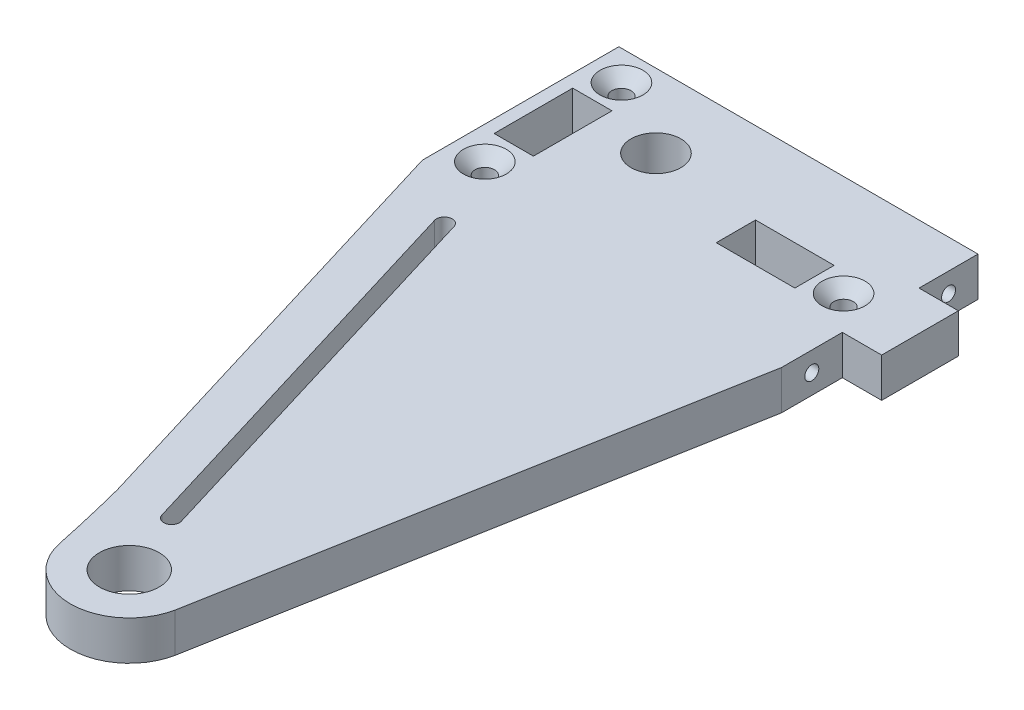
ISO-10303-21;
HEADER;
FILE_DESCRIPTION(('STEP AP214'),'2;1');
FILE_NAME('part.step','',(''),(''),'','','');
FILE_SCHEMA(('AUTOMOTIVE_DESIGN { 1 0 10303 214 1 1 1 1 }'));
ENDSEC;
DATA;
#1=APPLICATION_CONTEXT('core data for automotive mechanical design processes');
#2=APPLICATION_PROTOCOL_DEFINITION('international standard','automotive_design',2000,#1);
#3=PRODUCT_CONTEXT('',#1,'mechanical');
#4=PRODUCT('Part','Part','',(#3));
#5=PRODUCT_RELATED_PRODUCT_CATEGORY('part','',(#4));
#6=PRODUCT_DEFINITION_FORMATION('','',#4);
#7=PRODUCT_DEFINITION_CONTEXT('part definition',#1,'design');
#8=PRODUCT_DEFINITION('design','',#6,#7);
#9=PRODUCT_DEFINITION_SHAPE('','',#8);
#10=(LENGTH_UNIT() NAMED_UNIT(*) SI_UNIT(.MILLI.,.METRE.));
#11=(NAMED_UNIT(*) PLANE_ANGLE_UNIT() SI_UNIT($,.RADIAN.));
#12=(NAMED_UNIT(*) SI_UNIT($,.STERADIAN.) SOLID_ANGLE_UNIT());
#13=UNCERTAINTY_MEASURE_WITH_UNIT(LENGTH_MEASURE(1.E-05),#10,'distance_accuracy_value','');
#14=(GEOMETRIC_REPRESENTATION_CONTEXT(3) GLOBAL_UNCERTAINTY_ASSIGNED_CONTEXT((#13)) GLOBAL_UNIT_ASSIGNED_CONTEXT((#10,
#11,#12)) REPRESENTATION_CONTEXT('',''));
#15=CARTESIAN_POINT('',(0.,0.,0.));
#16=DIRECTION('',(0.,0.,1.));
#17=DIRECTION('',(1.,0.,0.));
#18=AXIS2_PLACEMENT_3D('',#15,#16,#17);
#19=CARTESIAN_POINT('',(0.,6.35,0.));
#20=DIRECTION('',(0.,1.,0.));
#21=DIRECTION('',(0.,0.,1.));
#22=AXIS2_PLACEMENT_3D('',#19,#20,#21);
#23=PLANE('',#22);
#24=CARTESIAN_POINT('',(19.0431962450902,6.35,-96.393));
#25=DIRECTION('',(0.,1.,0.));
#26=DIRECTION('',(0.,0.,1.));
#27=AXIS2_PLACEMENT_3D('',#24,#25,#26);
#28=CIRCLE('',#27,3.46709999999997);
#29=CARTESIAN_POINT('',(19.0431962450902,6.35,-92.9259));
#30=VERTEX_POINT('',#29);
#31=EDGE_CURVE('E385',#30,#30,#28,.F.);
#32=ORIENTED_EDGE('',*,*,#31,.T.);
#33=EDGE_LOOP('',(#32));
#34=FACE_BOUND('',#33,.T.);
#35=CARTESIAN_POINT('',(-28.394285298128,6.35,-85.856962938398));
#36=DIRECTION('',(0.,1.,0.));
#37=DIRECTION('',(0.,0.,1.));
#38=AXIS2_PLACEMENT_3D('',#35,#36,#37);
#39=CIRCLE('',#38,3.46709999999997);
#40=CARTESIAN_POINT('',(-28.394285298128,6.35,-82.389862938398));
#41=VERTEX_POINT('',#40);
#42=EDGE_CURVE('E382',#41,#41,#39,.F.);
#43=ORIENTED_EDGE('',*,*,#42,.T.);
#44=EDGE_LOOP('',(#43));
#45=FACE_BOUND('',#44,.T.);
#46=CARTESIAN_POINT('',(-28.4151324493854,6.35,-107.954943271274));
#47=DIRECTION('',(0.,1.,0.));
#48=DIRECTION('',(0.,0.,1.));
#49=AXIS2_PLACEMENT_3D('',#46,#47,#48);
#50=CIRCLE('',#49,3.46709999999997);
#51=CARTESIAN_POINT('',(-28.4151324493854,6.35,-104.487843271274));
#52=VERTEX_POINT('',#51);
#53=EDGE_CURVE('E379',#52,#52,#50,.F.);
#54=ORIENTED_EDGE('',*,*,#53,.T.);
#55=EDGE_LOOP('',(#54));
#56=FACE_BOUND('',#55,.T.);
#57=DIRECTION('',(-0.29042094398933,0.,-0.956898989074785));
#58=VECTOR('',#57,1.);
#59=CARTESIAN_POINT('',(-2.60239940005327,6.35,-11.0218358933724));
#60=LINE('',#59,#58);
#61=CARTESIAN_POINT('',(-2.60239940005327,6.35,-11.0218358933724));
#62=VERTEX_POINT('',#61);
#63=CARTESIAN_POINT('',(-21.812532437852,6.35,-74.3167092980163));
#64=VERTEX_POINT('',#63);
#65=EDGE_CURVE('E231',#62,#64,#60,.T.);
#66=ORIENTED_EDGE('',*,*,#65,.F.);
#67=CARTESIAN_POINT('',(-3.81766111617824,6.35,-10.653001294506));
#68=DIRECTION('',(0.,1.,0.));
#69=DIRECTION('',(0.,0.,1.));
#70=AXIS2_PLACEMENT_3D('',#67,#68,#69);
#71=CIRCLE('',#70,1.27);
#72=CARTESIAN_POINT('',(-5.03292283230322,6.35,-10.2841666956395));
#73=VERTEX_POINT('',#72);
#74=EDGE_CURVE('E229',#73,#62,#71,.T.);
#75=ORIENTED_EDGE('',*,*,#74,.F.);
#76=DIRECTION('',(0.29042094398933,0.,0.956898989074785));
#77=VECTOR('',#76,1.);
#78=CARTESIAN_POINT('',(-5.03292283230322,6.35,-10.2841666956395));
#79=LINE('',#78,#77);
#80=CARTESIAN_POINT('',(-24.243055870102,6.35,-73.5790401002834));
#81=VERTEX_POINT('',#80);
#82=EDGE_CURVE('E237',#81,#73,#79,.T.);
#83=ORIENTED_EDGE('',*,*,#82,.F.);
#84=CARTESIAN_POINT('',(-23.027794153977,6.35,-73.9478746991498));
#85=DIRECTION('',(0.,1.,0.));
#86=DIRECTION('',(0.,0.,1.));
#87=AXIS2_PLACEMENT_3D('',#84,#85,#86);
#88=CIRCLE('',#87,1.27);
#89=EDGE_CURVE('E234',#64,#81,#88,.T.);
#90=ORIENTED_EDGE('',*,*,#89,.F.);
#91=EDGE_LOOP('',(#66,#75,#83,#90));
#92=FACE_BOUND('',#91,.T.);
#93=CARTESIAN_POINT('',(0.,6.35,0.));
#94=DIRECTION('',(0.,1.,0.));
#95=DIRECTION('',(0.,0.,1.));
#96=AXIS2_PLACEMENT_3D('',#93,#94,#95);
#97=CIRCLE('',#96,4.826);
#98=CARTESIAN_POINT('',(0.,6.35,4.826));
#99=VERTEX_POINT('',#98);
#100=EDGE_CURVE('E291',#99,#99,#97,.T.);
#101=ORIENTED_EDGE('',*,*,#100,.F.);
#102=EDGE_LOOP('',(#101));
#103=FACE_BOUND('',#102,.T.);
#104=DIRECTION('',(-1.,0.,0.));
#105=VECTOR('',#104,1.);
#106=CARTESIAN_POINT('',(24.384,6.35,-103.251));
#107=LINE('',#106,#105);
#108=CARTESIAN_POINT('',(30.734,6.35,-103.251));
#109=VERTEX_POINT('',#108);
#110=CARTESIAN_POINT('',(24.384,6.35,-103.251));
#111=VERTEX_POINT('',#110);
#112=EDGE_CURVE('E297',#109,#111,#107,.T.);
#113=ORIENTED_EDGE('',*,*,#112,.T.);
#114=DIRECTION('',(0.,0.,-1.));
#115=VECTOR('',#114,1.);
#116=CARTESIAN_POINT('',(24.384,6.35,-112.776));
#117=LINE('',#116,#115);
#118=CARTESIAN_POINT('',(24.384,6.35,-112.776));
#119=VERTEX_POINT('',#118);
#120=EDGE_CURVE('E300',#111,#119,#117,.T.);
#121=ORIENTED_EDGE('',*,*,#120,.T.);
#122=DIRECTION('',(-1.,0.,0.));
#123=VECTOR('',#122,1.);
#124=CARTESIAN_POINT('',(24.384,6.35,-112.776));
#125=LINE('',#124,#123);
#126=CARTESIAN_POINT('',(-33.655,6.35,-112.776));
#127=VERTEX_POINT('',#126);
#128=EDGE_CURVE('E303',#119,#127,#125,.T.);
#129=ORIENTED_EDGE('',*,*,#128,.T.);
#130=DIRECTION('',(0.,0.,1.));
#131=VECTOR('',#130,1.);
#132=CARTESIAN_POINT('',(-33.655,6.35,-112.776));
#133=LINE('',#132,#131);
#134=CARTESIAN_POINT('',(-33.655,6.35,-81.026));
#135=VERTEX_POINT('',#134);
#136=EDGE_CURVE('E305',#127,#135,#133,.T.);
#137=ORIENTED_EDGE('',*,*,#136,.T.);
#138=DIRECTION('',(0.29042094398933,0.,0.956898989074786));
#139=VECTOR('',#138,1.);
#140=CARTESIAN_POINT('',(-33.655,6.35,-81.026));
#141=LINE('',#140,#139);
#142=CARTESIAN_POINT('',(-12.1846982833551,6.35,-10.2841666956395));
#143=VERTEX_POINT('',#142);
#144=EDGE_CURVE('E307',#135,#143,#141,.T.);
#145=ORIENTED_EDGE('',*,*,#144,.T.);
#146=CARTESIAN_POINT('',(-273.056211371,6.35,57.1826039304755));
#147=DIRECTION('',(0.,-1.,0.));
#148=DIRECTION('',(0.,0.,-1.));
#149=AXIS2_PLACEMENT_3D('',#146,#147,#148);
#150=CIRCLE('',#149,269.454470141718);
#151=CARTESIAN_POINT('',(-9.32276633828133,6.35,1.95234546169688));
#152=VERTEX_POINT('',#151);
#153=EDGE_CURVE('E309',#143,#152,#150,.T.);
#154=ORIENTED_EDGE('',*,*,#153,.T.);
#155=CARTESIAN_POINT('',(0.,6.35,0.));
#156=DIRECTION('',(0.,1.,0.));
#157=DIRECTION('',(0.,0.,1.));
#158=AXIS2_PLACEMENT_3D('',#155,#156,#157);
#159=CIRCLE('',#158,9.525);
#160=CARTESIAN_POINT('',(9.32276633828134,6.35,1.95234546169686));
#161=VERTEX_POINT('',#160);
#162=EDGE_CURVE('E311',#152,#161,#159,.T.);
#163=ORIENTED_EDGE('',*,*,#162,.T.);
#164=DIRECTION('',(0.17859000271135,0.,-0.983923579822925));
#165=VECTOR('',#164,1.);
#166=CARTESIAN_POINT('',(24.384,6.35,-81.026));
#167=LINE('',#166,#165);
#168=CARTESIAN_POINT('',(24.384,6.35,-81.026));
#169=VERTEX_POINT('',#168);
#170=EDGE_CURVE('E313',#161,#169,#167,.T.);
#171=ORIENTED_EDGE('',*,*,#170,.T.);
#172=DIRECTION('',(0.,0.,-1.));
#173=VECTOR('',#172,1.);
#174=CARTESIAN_POINT('',(24.384,6.35,-81.026));
#175=LINE('',#174,#173);
#176=CARTESIAN_POINT('',(24.384,6.35,-90.8558));
#177=VERTEX_POINT('',#176);
#178=EDGE_CURVE('E315',#169,#177,#175,.T.);
#179=ORIENTED_EDGE('',*,*,#178,.T.);
#180=DIRECTION('',(1.,0.,0.));
#181=VECTOR('',#180,1.);
#182=CARTESIAN_POINT('',(24.384,6.35,-90.8558));
#183=LINE('',#182,#181);
#184=CARTESIAN_POINT('',(30.734,6.35,-90.8558));
#185=VERTEX_POINT('',#184);
#186=EDGE_CURVE('E317',#177,#185,#183,.T.);
#187=ORIENTED_EDGE('',*,*,#186,.T.);
#188=DIRECTION('',(0.,0.,-1.));
#189=VECTOR('',#188,1.);
#190=CARTESIAN_POINT('',(30.734,6.35,-103.251));
#191=LINE('',#190,#189);
#192=EDGE_CURVE('E319',#185,#109,#191,.T.);
#193=ORIENTED_EDGE('',*,*,#192,.T.);
#194=EDGE_LOOP('',(#113,#121,#129,#137,#145,#154,#163,#171,#179,#187,#193));
#195=FACE_BOUND('',#194,.T.);
#196=DIRECTION('',(0.,0.,1.));
#197=VECTOR('',#196,1.);
#198=CARTESIAN_POINT('',(1.64420607865211,6.35,-99.568));
#199=LINE('',#198,#197);
#200=CARTESIAN_POINT('',(1.64420607865211,6.35,-99.568));
#201=VERTEX_POINT('',#200);
#202=CARTESIAN_POINT('',(1.64420607865211,6.35,-93.218));
#203=VERTEX_POINT('',#202);
#204=EDGE_CURVE('E262',#201,#203,#199,.T.);
#205=ORIENTED_EDGE('',*,*,#204,.F.);
#206=DIRECTION('',(-1.,0.,0.));
#207=VECTOR('',#206,1.);
#208=CARTESIAN_POINT('',(1.64420607865211,6.35,-99.568));
#209=LINE('',#208,#207);
#210=CARTESIAN_POINT('',(14.3442060786521,6.35,-99.568));
#211=VERTEX_POINT('',#210);
#212=EDGE_CURVE('E260',#211,#201,#209,.T.);
#213=ORIENTED_EDGE('',*,*,#212,.F.);
#214=DIRECTION('',(0.,0.,-1.));
#215=VECTOR('',#214,1.);
#216=CARTESIAN_POINT('',(14.3442060786521,6.35,-99.568));
#217=LINE('',#216,#215);
#218=CARTESIAN_POINT('',(14.3442060786521,6.35,-93.218));
#219=VERTEX_POINT('',#218);
#220=EDGE_CURVE('E268',#219,#211,#217,.T.);
#221=ORIENTED_EDGE('',*,*,#220,.F.);
#222=DIRECTION('',(1.,0.,0.));
#223=VECTOR('',#222,1.);
#224=CARTESIAN_POINT('',(1.64420607865211,6.35,-93.218));
#225=LINE('',#224,#223);
#226=EDGE_CURVE('E265',#203,#219,#225,.T.);
#227=ORIENTED_EDGE('',*,*,#226,.F.);
#228=EDGE_LOOP('',(#205,#213,#221,#227));
#229=FACE_BOUND('',#228,.T.);
#230=DIRECTION('',(-1.,0.,0.));
#231=VECTOR('',#230,1.);
#232=CARTESIAN_POINT('',(-25.2401324493854,6.35,-103.251));
#233=LINE('',#232,#231);
#234=CARTESIAN_POINT('',(-25.2401324493854,6.35,-103.251));
#235=VERTEX_POINT('',#234);
#236=CARTESIAN_POINT('',(-31.5901324493854,6.35,-103.251));
#237=VERTEX_POINT('',#236);
#238=EDGE_CURVE('E198',#235,#237,#233,.T.);
#239=ORIENTED_EDGE('',*,*,#238,.F.);
#240=DIRECTION('',(0.,0.,-1.));
#241=VECTOR('',#240,1.);
#242=CARTESIAN_POINT('',(-25.2401324493854,6.35,-103.251));
#243=LINE('',#242,#241);
#244=CARTESIAN_POINT('',(-25.2401324493854,6.35,-90.551));
#245=VERTEX_POINT('',#244);
#246=EDGE_CURVE('E190',#245,#235,#243,.T.);
#247=ORIENTED_EDGE('',*,*,#246,.F.);
#248=DIRECTION('',(1.,0.,0.));
#249=VECTOR('',#248,1.);
#250=CARTESIAN_POINT('',(-25.2401324493854,6.35,-90.551));
#251=LINE('',#250,#249);
#252=CARTESIAN_POINT('',(-31.5901324493854,6.35,-90.551));
#253=VERTEX_POINT('',#252);
#254=EDGE_CURVE('E213',#253,#245,#251,.T.);
#255=ORIENTED_EDGE('',*,*,#254,.F.);
#256=DIRECTION('',(0.,0.,1.));
#257=VECTOR('',#256,1.);
#258=CARTESIAN_POINT('',(-31.5901324493854,6.35,-103.251));
#259=LINE('',#258,#257);
#260=EDGE_CURVE('E211',#237,#253,#259,.T.);
#261=ORIENTED_EDGE('',*,*,#260,.F.);
#262=EDGE_LOOP('',(#239,#247,#255,#261));
#263=FACE_BOUND('',#262,.T.);
#264=CARTESIAN_POINT('',(-15.748,6.35,-100.8634));
#265=DIRECTION('',(0.,1.,0.));
#266=DIRECTION('',(0.,0.,1.));
#267=AXIS2_PLACEMENT_3D('',#264,#265,#266);
#268=CIRCLE('',#267,4.0386);
#269=CARTESIAN_POINT('',(-15.748,6.35,-96.8248));
#270=VERTEX_POINT('',#269);
#271=EDGE_CURVE('E760',#270,#270,#268,.T.);
#272=ORIENTED_EDGE('',*,*,#271,.F.);
#273=EDGE_LOOP('',(#272));
#274=FACE_BOUND('',#273,.T.);
#275=ADVANCED_FACE('F35',(#34,#45,#56,#92,#103,#195,#229,#263,#274),#23,.T.);
#276=CARTESIAN_POINT('',(0.,0.,0.));
#277=DIRECTION('',(0.,1.,0.));
#278=DIRECTION('',(0.,0.,1.));
#279=AXIS2_PLACEMENT_3D('',#276,#277,#278);
#280=PLANE('',#279);
#281=CARTESIAN_POINT('',(-28.394285298128,0.,-85.856962938398));
#282=DIRECTION('',(0.,1.,0.));
#283=DIRECTION('',(0.,0.,-1.));
#284=AXIS2_PLACEMENT_3D('',#281,#282,#283);
#285=CIRCLE('',#284,1.56209999999999);
#286=CARTESIAN_POINT('',(-28.394285298128,0.,-87.4190629383979));
#287=VERTEX_POINT('',#286);
#288=EDGE_CURVE('E763',#287,#287,#285,.T.);
#289=ORIENTED_EDGE('',*,*,#288,.T.);
#290=EDGE_LOOP('',(#289));
#291=FACE_BOUND('',#290,.T.);
#292=CARTESIAN_POINT('',(19.0431962450902,0.,-96.393));
#293=DIRECTION('',(0.,1.,0.));
#294=DIRECTION('',(0.,0.,-1.));
#295=AXIS2_PLACEMENT_3D('',#292,#293,#294);
#296=CIRCLE('',#295,1.56209999999998);
#297=CARTESIAN_POINT('',(19.0431962450902,0.,-97.9551));
#298=VERTEX_POINT('',#297);
#299=EDGE_CURVE('E219',#298,#298,#296,.T.);
#300=ORIENTED_EDGE('',*,*,#299,.T.);
#301=EDGE_LOOP('',(#300));
#302=FACE_BOUND('',#301,.T.);
#303=CARTESIAN_POINT('',(-3.81766111617824,0.,-10.653001294506));
#304=DIRECTION('',(0.,1.,0.));
#305=DIRECTION('',(0.,0.,1.));
#306=AXIS2_PLACEMENT_3D('',#303,#304,#305);
#307=CIRCLE('',#306,1.27);
#308=CARTESIAN_POINT('',(-5.03292283230322,0.,-10.2841666956395));
#309=VERTEX_POINT('',#308);
#310=CARTESIAN_POINT('',(-2.60239940005327,0.,-11.0218358933724));
#311=VERTEX_POINT('',#310);
#312=EDGE_CURVE('E206',#309,#311,#307,.T.);
#313=ORIENTED_EDGE('',*,*,#312,.T.);
#314=DIRECTION('',(-0.29042094398933,0.,-0.956898989074785));
#315=VECTOR('',#314,1.);
#316=CARTESIAN_POINT('',(-2.60239940005327,0.,-11.0218358933724));
#317=LINE('',#316,#315);
#318=CARTESIAN_POINT('',(-21.812532437852,0.,-74.3167092980163));
#319=VERTEX_POINT('',#318);
#320=EDGE_CURVE('E242',#311,#319,#317,.T.);
#321=ORIENTED_EDGE('',*,*,#320,.T.);
#322=CARTESIAN_POINT('',(-23.027794153977,0.,-73.9478746991498));
#323=DIRECTION('',(0.,1.,0.));
#324=DIRECTION('',(0.,0.,1.));
#325=AXIS2_PLACEMENT_3D('',#322,#323,#324);
#326=CIRCLE('',#325,1.27);
#327=CARTESIAN_POINT('',(-24.243055870102,0.,-73.5790401002834));
#328=VERTEX_POINT('',#327);
#329=EDGE_CURVE('E245',#319,#328,#326,.T.);
#330=ORIENTED_EDGE('',*,*,#329,.T.);
#331=DIRECTION('',(0.29042094398933,0.,0.956898989074785));
#332=VECTOR('',#331,1.);
#333=CARTESIAN_POINT('',(-5.03292283230322,0.,-10.2841666956395));
#334=LINE('',#333,#332);
#335=EDGE_CURVE('E232',#328,#309,#334,.T.);
#336=ORIENTED_EDGE('',*,*,#335,.T.);
#337=EDGE_LOOP('',(#313,#321,#330,#336));
#338=FACE_BOUND('',#337,.T.);
#339=CARTESIAN_POINT('',(0.,0.,0.));
#340=DIRECTION('',(0.,1.,0.));
#341=DIRECTION('',(0.,0.,1.));
#342=AXIS2_PLACEMENT_3D('',#339,#340,#341);
#343=CIRCLE('',#342,4.826);
#344=CARTESIAN_POINT('',(0.,0.,4.826));
#345=VERTEX_POINT('',#344);
#346=EDGE_CURVE('E290',#345,#345,#343,.T.);
#347=ORIENTED_EDGE('',*,*,#346,.T.);
#348=EDGE_LOOP('',(#347));
#349=FACE_BOUND('',#348,.T.);
#350=DIRECTION('',(-1.,0.,0.));
#351=VECTOR('',#350,1.);
#352=CARTESIAN_POINT('',(24.384,0.,-103.251));
#353=LINE('',#352,#351);
#354=CARTESIAN_POINT('',(30.734,0.,-103.251));
#355=VERTEX_POINT('',#354);
#356=CARTESIAN_POINT('',(24.384,0.,-103.251));
#357=VERTEX_POINT('',#356);
#358=EDGE_CURVE('E294',#355,#357,#353,.T.);
#359=ORIENTED_EDGE('',*,*,#358,.F.);
#360=DIRECTION('',(0.,0.,-1.));
#361=VECTOR('',#360,1.);
#362=CARTESIAN_POINT('',(30.734,0.,-103.251));
#363=LINE('',#362,#361);
#364=CARTESIAN_POINT('',(30.734,0.,-90.8558));
#365=VERTEX_POINT('',#364);
#366=EDGE_CURVE('E301',#365,#355,#363,.T.);
#367=ORIENTED_EDGE('',*,*,#366,.F.);
#368=DIRECTION('',(1.,0.,0.));
#369=VECTOR('',#368,1.);
#370=CARTESIAN_POINT('',(24.384,0.,-90.8558));
#371=LINE('',#370,#369);
#372=CARTESIAN_POINT('',(24.384,0.,-90.8558));
#373=VERTEX_POINT('',#372);
#374=EDGE_CURVE('E341',#373,#365,#371,.T.);
#375=ORIENTED_EDGE('',*,*,#374,.F.);
#376=DIRECTION('',(0.,0.,-1.));
#377=VECTOR('',#376,1.);
#378=CARTESIAN_POINT('',(24.384,0.,-81.026));
#379=LINE('',#378,#377);
#380=CARTESIAN_POINT('',(24.384,0.,-81.026));
#381=VERTEX_POINT('',#380);
#382=EDGE_CURVE('E339',#381,#373,#379,.T.);
#383=ORIENTED_EDGE('',*,*,#382,.F.);
#384=DIRECTION('',(0.17859000271135,0.,-0.983923579822925));
#385=VECTOR('',#384,1.);
#386=CARTESIAN_POINT('',(24.384,0.,-81.026));
#387=LINE('',#386,#385);
#388=CARTESIAN_POINT('',(9.32276633828134,0.,1.95234546169686));
#389=VERTEX_POINT('',#388);
#390=EDGE_CURVE('E337',#389,#381,#387,.T.);
#391=ORIENTED_EDGE('',*,*,#390,.F.);
#392=CARTESIAN_POINT('',(0.,0.,0.));
#393=DIRECTION('',(0.,1.,0.));
#394=DIRECTION('',(0.,0.,1.));
#395=AXIS2_PLACEMENT_3D('',#392,#393,#394);
#396=CIRCLE('',#395,9.525);
#397=CARTESIAN_POINT('',(-9.32276633828133,0.,1.95234546169688));
#398=VERTEX_POINT('',#397);
#399=EDGE_CURVE('E335',#398,#389,#396,.T.);
#400=ORIENTED_EDGE('',*,*,#399,.F.);
#401=CARTESIAN_POINT('',(-273.056211371,0.,57.1826039304755));
#402=DIRECTION('',(0.,-1.,0.));
#403=DIRECTION('',(0.,0.,-1.));
#404=AXIS2_PLACEMENT_3D('',#401,#402,#403);
#405=CIRCLE('',#404,269.454470141718);
#406=CARTESIAN_POINT('',(-12.1846982833551,0.,-10.2841666956395));
#407=VERTEX_POINT('',#406);
#408=EDGE_CURVE('E333',#407,#398,#405,.T.);
#409=ORIENTED_EDGE('',*,*,#408,.F.);
#410=DIRECTION('',(0.29042094398933,0.,0.956898989074786));
#411=VECTOR('',#410,1.);
#412=CARTESIAN_POINT('',(-33.655,0.,-81.026));
#413=LINE('',#412,#411);
#414=CARTESIAN_POINT('',(-33.655,0.,-81.026));
#415=VERTEX_POINT('',#414);
#416=EDGE_CURVE('E331',#415,#407,#413,.T.);
#417=ORIENTED_EDGE('',*,*,#416,.F.);
#418=DIRECTION('',(0.,0.,1.));
#419=VECTOR('',#418,1.);
#420=CARTESIAN_POINT('',(-33.655,0.,-112.776));
#421=LINE('',#420,#419);
#422=CARTESIAN_POINT('',(-33.655,0.,-112.776));
#423=VERTEX_POINT('',#422);
#424=EDGE_CURVE('E329',#423,#415,#421,.T.);
#425=ORIENTED_EDGE('',*,*,#424,.F.);
#426=DIRECTION('',(-1.,0.,0.));
#427=VECTOR('',#426,1.);
#428=CARTESIAN_POINT('',(-30.48,0.,-112.776));
#429=LINE('',#428,#427);
#430=CARTESIAN_POINT('',(24.384,0.,-112.776));
#431=VERTEX_POINT('',#430);
#432=EDGE_CURVE('E327',#431,#423,#429,.T.);
#433=ORIENTED_EDGE('',*,*,#432,.F.);
#434=DIRECTION('',(0.,0.,-1.));
#435=VECTOR('',#434,1.);
#436=CARTESIAN_POINT('',(24.384,0.,-112.776));
#437=LINE('',#436,#435);
#438=EDGE_CURVE('E324',#357,#431,#437,.T.);
#439=ORIENTED_EDGE('',*,*,#438,.F.);
#440=EDGE_LOOP('',(#359,#367,#375,#383,#391,#400,#409,#417,#425,#433,#439));
#441=FACE_BOUND('',#440,.T.);
#442=DIRECTION('',(-1.,0.,0.));
#443=VECTOR('',#442,1.);
#444=CARTESIAN_POINT('',(1.64420607865211,0.,-99.568));
#445=LINE('',#444,#443);
#446=CARTESIAN_POINT('',(14.3442060786521,0.,-99.568));
#447=VERTEX_POINT('',#446);
#448=CARTESIAN_POINT('',(1.64420607865211,0.,-99.568));
#449=VERTEX_POINT('',#448);
#450=EDGE_CURVE('E259',#447,#449,#445,.T.);
#451=ORIENTED_EDGE('',*,*,#450,.T.);
#452=DIRECTION('',(0.,0.,1.));
#453=VECTOR('',#452,1.);
#454=CARTESIAN_POINT('',(1.64420607865211,0.,-99.568));
#455=LINE('',#454,#453);
#456=CARTESIAN_POINT('',(1.64420607865211,0.,-93.218));
#457=VERTEX_POINT('',#456);
#458=EDGE_CURVE('E273',#449,#457,#455,.T.);
#459=ORIENTED_EDGE('',*,*,#458,.T.);
#460=DIRECTION('',(1.,0.,0.));
#461=VECTOR('',#460,1.);
#462=CARTESIAN_POINT('',(1.64420607865211,0.,-93.218));
#463=LINE('',#462,#461);
#464=CARTESIAN_POINT('',(14.3442060786521,0.,-93.218));
#465=VERTEX_POINT('',#464);
#466=EDGE_CURVE('E276',#457,#465,#463,.T.);
#467=ORIENTED_EDGE('',*,*,#466,.T.);
#468=DIRECTION('',(0.,0.,-1.));
#469=VECTOR('',#468,1.);
#470=CARTESIAN_POINT('',(14.3442060786521,0.,-99.568));
#471=LINE('',#470,#469);
#472=EDGE_CURVE('E263',#465,#447,#471,.T.);
#473=ORIENTED_EDGE('',*,*,#472,.T.);
#474=EDGE_LOOP('',(#451,#459,#467,#473));
#475=FACE_BOUND('',#474,.T.);
#476=DIRECTION('',(0.,0.,-1.));
#477=VECTOR('',#476,1.);
#478=CARTESIAN_POINT('',(-25.2401324493854,0.,-103.251));
#479=LINE('',#478,#477);
#480=CARTESIAN_POINT('',(-25.2401324493854,0.,-90.551));
#481=VERTEX_POINT('',#480);
#482=CARTESIAN_POINT('',(-25.2401324493854,0.,-103.251));
#483=VERTEX_POINT('',#482);
#484=EDGE_CURVE('E58',#481,#483,#479,.T.);
#485=ORIENTED_EDGE('',*,*,#484,.T.);
#486=DIRECTION('',(-1.,0.,0.));
#487=VECTOR('',#486,1.);
#488=CARTESIAN_POINT('',(-25.2401324493854,0.,-103.251));
#489=LINE('',#488,#487);
#490=CARTESIAN_POINT('',(-31.5901324493854,0.,-103.251));
#491=VERTEX_POINT('',#490);
#492=EDGE_CURVE('E205',#483,#491,#489,.T.);
#493=ORIENTED_EDGE('',*,*,#492,.T.);
#494=DIRECTION('',(0.,0.,1.));
#495=VECTOR('',#494,1.);
#496=CARTESIAN_POINT('',(-31.5901324493854,0.,-103.251));
#497=LINE('',#496,#495);
#498=CARTESIAN_POINT('',(-31.5901324493854,0.,-90.551));
#499=VERTEX_POINT('',#498);
#500=EDGE_CURVE('E221',#491,#499,#497,.T.);
#501=ORIENTED_EDGE('',*,*,#500,.T.);
#502=DIRECTION('',(1.,0.,0.));
#503=VECTOR('',#502,1.);
#504=CARTESIAN_POINT('',(-25.2401324493854,0.,-90.551));
#505=LINE('',#504,#503);
#506=EDGE_CURVE('E199',#499,#481,#505,.T.);
#507=ORIENTED_EDGE('',*,*,#506,.T.);
#508=EDGE_LOOP('',(#485,#493,#501,#507));
#509=FACE_BOUND('',#508,.T.);
#510=CARTESIAN_POINT('',(-28.4151324493854,0.,-107.954943271274));
#511=DIRECTION('',(0.,1.,0.));
#512=DIRECTION('',(0.,0.,1.));
#513=AXIS2_PLACEMENT_3D('',#510,#511,#512);
#514=CIRCLE('',#513,1.5621);
#515=CARTESIAN_POINT('',(-28.4151324493854,0.,-106.392843271274));
#516=VERTEX_POINT('',#515);
#517=EDGE_CURVE('E768',#516,#516,#514,.T.);
#518=ORIENTED_EDGE('',*,*,#517,.T.);
#519=EDGE_LOOP('',(#518));
#520=FACE_BOUND('',#519,.T.);
#521=CARTESIAN_POINT('',(-15.748,0.,-100.8634));
#522=DIRECTION('',(0.,1.,0.));
#523=DIRECTION('',(0.,0.,1.));
#524=AXIS2_PLACEMENT_3D('',#521,#522,#523);
#525=CIRCLE('',#524,4.0386);
#526=CARTESIAN_POINT('',(-15.748,0.,-96.8248));
#527=VERTEX_POINT('',#526);
#528=EDGE_CURVE('E758',#527,#527,#525,.T.);
#529=ORIENTED_EDGE('',*,*,#528,.T.);
#530=EDGE_LOOP('',(#529));
#531=FACE_BOUND('',#530,.T.);
#532=ADVANCED_FACE('F407',(#291,#302,#338,#349,#441,#475,#509,#520,#531),#280,.F.);
#533=CARTESIAN_POINT('',(24.384,6.35,-103.251));
#534=DIRECTION('',(0.,0.,1.));
#535=DIRECTION('',(1.,0.,0.));
#536=AXIS2_PLACEMENT_3D('',#533,#534,#535);
#537=PLANE('',#536);
#538=ORIENTED_EDGE('',*,*,#358,.T.);
#539=DIRECTION('',(0.,-1.,0.));
#540=VECTOR('',#539,1.);
#541=CARTESIAN_POINT('',(24.384,6.35,-103.251));
#542=LINE('',#541,#540);
#543=EDGE_CURVE('E373',#111,#357,#542,.T.);
#544=ORIENTED_EDGE('',*,*,#543,.F.);
#545=ORIENTED_EDGE('',*,*,#112,.F.);
#546=DIRECTION('',(0.,-1.,0.));
#547=VECTOR('',#546,1.);
#548=CARTESIAN_POINT('',(30.734,6.35,-103.251));
#549=LINE('',#548,#547);
#550=EDGE_CURVE('E321',#109,#355,#549,.T.);
#551=ORIENTED_EDGE('',*,*,#550,.T.);
#552=EDGE_LOOP('',(#538,#544,#545,#551));
#553=FACE_BOUND('',#552,.T.);
#554=ADVANCED_FACE('F415',(#553),#537,.F.);
#555=CARTESIAN_POINT('',(24.384,6.35,-112.776));
#556=DIRECTION('',(-1.,0.,0.));
#557=DIRECTION('',(0.,0.,1.));
#558=AXIS2_PLACEMENT_3D('',#555,#556,#557);
#559=PLANE('',#558);
#560=CARTESIAN_POINT('',(24.384,3.175,-108.0135));
#561=DIRECTION('',(1.,0.,0.));
#562=DIRECTION('',(0.,0.,-1.));
#563=AXIS2_PLACEMENT_3D('',#560,#561,#562);
#564=CIRCLE('',#563,1.1303);
#565=CARTESIAN_POINT('',(24.384,3.175,-109.1438));
#566=VERTEX_POINT('',#565);
#567=EDGE_CURVE('E748',#566,#566,#564,.T.);
#568=ORIENTED_EDGE('',*,*,#567,.F.);
#569=EDGE_LOOP('',(#568));
#570=FACE_BOUND('',#569,.T.);
#571=ORIENTED_EDGE('',*,*,#438,.T.);
#572=DIRECTION('',(0.,-1.,0.));
#573=VECTOR('',#572,1.);
#574=CARTESIAN_POINT('',(24.384,6.35,-112.776));
#575=LINE('',#574,#573);
#576=EDGE_CURVE('E370',#119,#431,#575,.T.);
#577=ORIENTED_EDGE('',*,*,#576,.F.);
#578=ORIENTED_EDGE('',*,*,#120,.F.);
#579=ORIENTED_EDGE('',*,*,#543,.T.);
#580=EDGE_LOOP('',(#571,#577,#578,#579));
#581=FACE_BOUND('',#580,.T.);
#582=ADVANCED_FACE('F458',(#570,#581),#559,.F.);
#583=CARTESIAN_POINT('',(-30.48,6.35,-112.776));
#584=DIRECTION('',(0.,0.,1.));
#585=DIRECTION('',(1.,0.,0.));
#586=AXIS2_PLACEMENT_3D('',#583,#584,#585);
#587=PLANE('',#586);
#588=ORIENTED_EDGE('',*,*,#432,.T.);
#589=DIRECTION('',(0.,-1.,0.));
#590=VECTOR('',#589,1.);
#591=CARTESIAN_POINT('',(-33.655,6.35,-112.776));
#592=LINE('',#591,#590);
#593=EDGE_CURVE('E367',#127,#423,#592,.T.);
#594=ORIENTED_EDGE('',*,*,#593,.F.);
#595=ORIENTED_EDGE('',*,*,#128,.F.);
#596=ORIENTED_EDGE('',*,*,#576,.T.);
#597=EDGE_LOOP('',(#588,#594,#595,#596));
#598=FACE_BOUND('',#597,.T.);
#599=ADVANCED_FACE('F454',(#598),#587,.F.);
#600=CARTESIAN_POINT('',(-33.655,6.35,-112.776));
#601=DIRECTION('',(1.,0.,0.));
#602=DIRECTION('',(0.,0.,-1.));
#603=AXIS2_PLACEMENT_3D('',#600,#601,#602);
#604=PLANE('',#603);
#605=ORIENTED_EDGE('',*,*,#424,.T.);
#606=DIRECTION('',(0.,-1.,0.));
#607=VECTOR('',#606,1.);
#608=CARTESIAN_POINT('',(-33.655,6.35,-81.026));
#609=LINE('',#608,#607);
#610=EDGE_CURVE('E364',#135,#415,#609,.T.);
#611=ORIENTED_EDGE('',*,*,#610,.F.);
#612=ORIENTED_EDGE('',*,*,#136,.F.);
#613=ORIENTED_EDGE('',*,*,#593,.T.);
#614=EDGE_LOOP('',(#605,#611,#612,#613));
#615=FACE_BOUND('',#614,.T.);
#616=ADVANCED_FACE('F450',(#615),#604,.F.);
#617=CARTESIAN_POINT('',(-33.655,6.35,-81.026));
#618=DIRECTION('',(0.956898989074786,0.,-0.29042094398933));
#619=DIRECTION('',(-0.29042094398933,0.,-0.956898989074786));
#620=AXIS2_PLACEMENT_3D('',#617,#618,#619);
#621=PLANE('',#620);
#622=ORIENTED_EDGE('',*,*,#416,.T.);
#623=DIRECTION('',(0.,-1.,0.));
#624=VECTOR('',#623,1.);
#625=CARTESIAN_POINT('',(-12.1846982833551,6.35,-10.2841666956395));
#626=LINE('',#625,#624);
#627=EDGE_CURVE('E361',#143,#407,#626,.T.);
#628=ORIENTED_EDGE('',*,*,#627,.F.);
#629=ORIENTED_EDGE('',*,*,#144,.F.);
#630=ORIENTED_EDGE('',*,*,#610,.T.);
#631=EDGE_LOOP('',(#622,#628,#629,#630));
#632=FACE_BOUND('',#631,.T.);
#633=ADVANCED_FACE('F446',(#632),#621,.F.);
#634=CARTESIAN_POINT('',(-273.056211371,6.35,57.1826039304755));
#635=DIRECTION('',(0.,-1.,0.));
#636=DIRECTION('',(0.,0.,-1.));
#637=AXIS2_PLACEMENT_3D('',#634,#635,#636);
#638=CYLINDRICAL_SURFACE('',#637,269.454470141718);
#639=ORIENTED_EDGE('',*,*,#408,.T.);
#640=DIRECTION('',(0.,-1.,0.));
#641=VECTOR('',#640,1.);
#642=CARTESIAN_POINT('',(-9.32276633828133,6.35,1.95234546169688));
#643=LINE('',#642,#641);
#644=EDGE_CURVE('E358',#152,#398,#643,.T.);
#645=ORIENTED_EDGE('',*,*,#644,.F.);
#646=ORIENTED_EDGE('',*,*,#153,.F.);
#647=ORIENTED_EDGE('',*,*,#627,.T.);
#648=EDGE_LOOP('',(#639,#645,#646,#647));
#649=FACE_BOUND('',#648,.T.);
#650=ADVANCED_FACE('F442',(#649),#638,.F.);
#651=CARTESIAN_POINT('',(0.,6.35,0.));
#652=DIRECTION('',(0.,-1.,0.));
#653=DIRECTION('',(0.,0.,-1.));
#654=AXIS2_PLACEMENT_3D('',#651,#652,#653);
#655=CYLINDRICAL_SURFACE('',#654,9.525);
#656=ORIENTED_EDGE('',*,*,#399,.T.);
#657=DIRECTION('',(0.,-1.,0.));
#658=VECTOR('',#657,1.);
#659=CARTESIAN_POINT('',(9.32276633828134,6.35,1.95234546169686));
#660=LINE('',#659,#658);
#661=EDGE_CURVE('E355',#161,#389,#660,.T.);
#662=ORIENTED_EDGE('',*,*,#661,.F.);
#663=ORIENTED_EDGE('',*,*,#162,.F.);
#664=ORIENTED_EDGE('',*,*,#644,.T.);
#665=EDGE_LOOP('',(#656,#662,#663,#664));
#666=FACE_BOUND('',#665,.T.);
#667=ADVANCED_FACE('F438',(#666),#655,.T.);
#668=CARTESIAN_POINT('',(24.384,6.35,-81.026));
#669=DIRECTION('',(-0.983923579822925,0.,-0.17859000271135));
#670=DIRECTION('',(-0.17859000271135,0.,0.983923579822925));
#671=AXIS2_PLACEMENT_3D('',#668,#669,#670);
#672=PLANE('',#671);
#673=ORIENTED_EDGE('',*,*,#390,.T.);
#674=DIRECTION('',(0.,-1.,0.));
#675=VECTOR('',#674,1.);
#676=CARTESIAN_POINT('',(24.384,6.35,-81.026));
#677=LINE('',#676,#675);
#678=EDGE_CURVE('E352',#169,#381,#677,.T.);
#679=ORIENTED_EDGE('',*,*,#678,.F.);
#680=ORIENTED_EDGE('',*,*,#170,.F.);
#681=ORIENTED_EDGE('',*,*,#661,.T.);
#682=EDGE_LOOP('',(#673,#679,#680,#681));
#683=FACE_BOUND('',#682,.T.);
#684=ADVANCED_FACE('F434',(#683),#672,.F.);
#685=CARTESIAN_POINT('',(24.384,6.35,-81.026));
#686=DIRECTION('',(-1.,0.,0.));
#687=DIRECTION('',(0.,0.,1.));
#688=AXIS2_PLACEMENT_3D('',#685,#686,#687);
#689=PLANE('',#688);
#690=CARTESIAN_POINT('',(24.384,3.175,-85.9155));
#691=DIRECTION('',(1.,0.,0.));
#692=DIRECTION('',(0.,0.,1.));
#693=AXIS2_PLACEMENT_3D('',#690,#691,#692);
#694=CIRCLE('',#693,1.1303);
#695=CARTESIAN_POINT('',(24.384,3.175,-84.7852));
#696=VERTEX_POINT('',#695);
#697=EDGE_CURVE('E749',#696,#696,#694,.T.);
#698=ORIENTED_EDGE('',*,*,#697,.F.);
#699=EDGE_LOOP('',(#698));
#700=FACE_BOUND('',#699,.T.);
#701=ORIENTED_EDGE('',*,*,#382,.T.);
#702=DIRECTION('',(0.,-1.,0.));
#703=VECTOR('',#702,1.);
#704=CARTESIAN_POINT('',(24.384,6.35,-90.8558));
#705=LINE('',#704,#703);
#706=EDGE_CURVE('E349',#177,#373,#705,.T.);
#707=ORIENTED_EDGE('',*,*,#706,.F.);
#708=ORIENTED_EDGE('',*,*,#178,.F.);
#709=ORIENTED_EDGE('',*,*,#678,.T.);
#710=EDGE_LOOP('',(#701,#707,#708,#709));
#711=FACE_BOUND('',#710,.T.);
#712=ADVANCED_FACE('F430',(#700,#711),#689,.F.);
#713=CARTESIAN_POINT('',(24.384,6.35,-90.8558));
#714=DIRECTION('',(0.,0.,-1.));
#715=DIRECTION('',(-1.,0.,0.));
#716=AXIS2_PLACEMENT_3D('',#713,#714,#715);
#717=PLANE('',#716);
#718=ORIENTED_EDGE('',*,*,#374,.T.);
#719=DIRECTION('',(0.,-1.,0.));
#720=VECTOR('',#719,1.);
#721=CARTESIAN_POINT('',(30.734,6.35,-90.8558));
#722=LINE('',#721,#720);
#723=EDGE_CURVE('E346',#185,#365,#722,.T.);
#724=ORIENTED_EDGE('',*,*,#723,.F.);
#725=ORIENTED_EDGE('',*,*,#186,.F.);
#726=ORIENTED_EDGE('',*,*,#706,.T.);
#727=EDGE_LOOP('',(#718,#724,#725,#726));
#728=FACE_BOUND('',#727,.T.);
#729=ADVANCED_FACE('F426',(#728),#717,.F.);
#730=CARTESIAN_POINT('',(30.734,6.35,-103.251));
#731=DIRECTION('',(-1.,0.,0.));
#732=DIRECTION('',(0.,0.,1.));
#733=AXIS2_PLACEMENT_3D('',#730,#731,#732);
#734=PLANE('',#733);
#735=ORIENTED_EDGE('',*,*,#366,.T.);
#736=ORIENTED_EDGE('',*,*,#550,.F.);
#737=ORIENTED_EDGE('',*,*,#192,.F.);
#738=ORIENTED_EDGE('',*,*,#723,.T.);
#739=EDGE_LOOP('',(#735,#736,#737,#738));
#740=FACE_BOUND('',#739,.T.);
#741=ADVANCED_FACE('F423',(#740),#734,.F.);
#742=CARTESIAN_POINT('',(0.,6.35,0.));
#743=DIRECTION('',(0.,-1.,0.));
#744=DIRECTION('',(0.,0.,-1.));
#745=AXIS2_PLACEMENT_3D('',#742,#743,#744);
#746=CYLINDRICAL_SURFACE('',#745,4.826);
#747=ORIENTED_EDGE('',*,*,#100,.T.);
#748=EDGE_LOOP('',(#747));
#749=FACE_BOUND('',#748,.T.);
#750=ORIENTED_EDGE('',*,*,#346,.F.);
#751=EDGE_LOOP('',(#750));
#752=FACE_BOUND('',#751,.T.);
#753=ADVANCED_FACE('F420',(#749,#752),#746,.F.);
#754=CARTESIAN_POINT('',(1.64420607865211,6.35,-99.568));
#755=DIRECTION('',(0.,0.,1.));
#756=DIRECTION('',(1.,0.,0.));
#757=AXIS2_PLACEMENT_3D('',#754,#755,#756);
#758=PLANE('',#757);
#759=ORIENTED_EDGE('',*,*,#450,.F.);
#760=DIRECTION('',(0.,-1.,0.));
#761=VECTOR('',#760,1.);
#762=CARTESIAN_POINT('',(14.3442060786521,6.35,-99.568));
#763=LINE('',#762,#761);
#764=EDGE_CURVE('E270',#211,#447,#763,.T.);
#765=ORIENTED_EDGE('',*,*,#764,.F.);
#766=ORIENTED_EDGE('',*,*,#212,.T.);
#767=DIRECTION('',(0.,-1.,0.));
#768=VECTOR('',#767,1.);
#769=CARTESIAN_POINT('',(1.64420607865211,6.35,-99.568));
#770=LINE('',#769,#768);
#771=EDGE_CURVE('E287',#201,#449,#770,.T.);
#772=ORIENTED_EDGE('',*,*,#771,.T.);
#773=EDGE_LOOP('',(#759,#765,#766,#772));
#774=FACE_BOUND('',#773,.T.);
#775=ADVANCED_FACE('F517',(#774),#758,.T.);
#776=CARTESIAN_POINT('',(1.64420607865211,6.35,-99.568));
#777=DIRECTION('',(1.,0.,0.));
#778=DIRECTION('',(0.,0.,-1.));
#779=AXIS2_PLACEMENT_3D('',#776,#777,#778);
#780=PLANE('',#779);
#781=ORIENTED_EDGE('',*,*,#458,.F.);
#782=ORIENTED_EDGE('',*,*,#771,.F.);
#783=ORIENTED_EDGE('',*,*,#204,.T.);
#784=DIRECTION('',(0.,-1.,0.));
#785=VECTOR('',#784,1.);
#786=CARTESIAN_POINT('',(1.64420607865211,6.35,-93.218));
#787=LINE('',#786,#785);
#788=EDGE_CURVE('E285',#203,#457,#787,.T.);
#789=ORIENTED_EDGE('',*,*,#788,.T.);
#790=EDGE_LOOP('',(#781,#782,#783,#789));
#791=FACE_BOUND('',#790,.T.);
#792=ADVANCED_FACE('F510',(#791),#780,.T.);
#793=CARTESIAN_POINT('',(1.64420607865211,6.35,-93.218));
#794=DIRECTION('',(0.,0.,-1.));
#795=DIRECTION('',(-1.,0.,0.));
#796=AXIS2_PLACEMENT_3D('',#793,#794,#795);
#797=PLANE('',#796);
#798=ORIENTED_EDGE('',*,*,#466,.F.);
#799=ORIENTED_EDGE('',*,*,#788,.F.);
#800=ORIENTED_EDGE('',*,*,#226,.T.);
#801=DIRECTION('',(0.,-1.,0.));
#802=VECTOR('',#801,1.);
#803=CARTESIAN_POINT('',(14.3442060786521,6.35,-93.218));
#804=LINE('',#803,#802);
#805=EDGE_CURVE('E283',#219,#465,#804,.T.);
#806=ORIENTED_EDGE('',*,*,#805,.T.);
#807=EDGE_LOOP('',(#798,#799,#800,#806));
#808=FACE_BOUND('',#807,.T.);
#809=ADVANCED_FACE('F513',(#808),#797,.T.);
#810=CARTESIAN_POINT('',(14.3442060786521,6.35,-99.568));
#811=DIRECTION('',(-1.,0.,0.));
#812=DIRECTION('',(0.,0.,1.));
#813=AXIS2_PLACEMENT_3D('',#810,#811,#812);
#814=PLANE('',#813);
#815=ORIENTED_EDGE('',*,*,#472,.F.);
#816=ORIENTED_EDGE('',*,*,#805,.F.);
#817=ORIENTED_EDGE('',*,*,#220,.T.);
#818=ORIENTED_EDGE('',*,*,#764,.T.);
#819=EDGE_LOOP('',(#815,#816,#817,#818));
#820=FACE_BOUND('',#819,.T.);
#821=ADVANCED_FACE('F520',(#820),#814,.T.);
#822=CARTESIAN_POINT('',(-3.81766111617824,6.35,-10.653001294506));
#823=DIRECTION('',(0.,-1.,0.));
#824=DIRECTION('',(0.,0.,-1.));
#825=AXIS2_PLACEMENT_3D('',#822,#823,#824);
#826=CYLINDRICAL_SURFACE('',#825,1.27);
#827=ORIENTED_EDGE('',*,*,#312,.F.);
#828=DIRECTION('',(0.,-1.,0.));
#829=VECTOR('',#828,1.);
#830=CARTESIAN_POINT('',(-5.03292283230322,6.35,-10.2841666956395));
#831=LINE('',#830,#829);
#832=EDGE_CURVE('E239',#73,#309,#831,.T.);
#833=ORIENTED_EDGE('',*,*,#832,.F.);
#834=ORIENTED_EDGE('',*,*,#74,.T.);
#835=DIRECTION('',(0.,-1.,0.));
#836=VECTOR('',#835,1.);
#837=CARTESIAN_POINT('',(-2.60239940005327,6.35,-11.0218358933724));
#838=LINE('',#837,#836);
#839=EDGE_CURVE('E256',#62,#311,#838,.T.);
#840=ORIENTED_EDGE('',*,*,#839,.T.);
#841=EDGE_LOOP('',(#827,#833,#834,#840));
#842=FACE_BOUND('',#841,.T.);
#843=ADVANCED_FACE('F522',(#842),#826,.F.);
#844=CARTESIAN_POINT('',(-2.60239940005327,6.35,-11.0218358933724));
#845=DIRECTION('',(-0.956898989074785,0.,0.29042094398933));
#846=DIRECTION('',(0.29042094398933,0.,0.956898989074786));
#847=AXIS2_PLACEMENT_3D('',#844,#845,#846);
#848=PLANE('',#847);
#849=ORIENTED_EDGE('',*,*,#320,.F.);
#850=ORIENTED_EDGE('',*,*,#839,.F.);
#851=ORIENTED_EDGE('',*,*,#65,.T.);
#852=DIRECTION('',(0.,-1.,0.));
#853=VECTOR('',#852,1.);
#854=CARTESIAN_POINT('',(-21.812532437852,6.35,-74.3167092980163));
#855=LINE('',#854,#853);
#856=EDGE_CURVE('E254',#64,#319,#855,.T.);
#857=ORIENTED_EDGE('',*,*,#856,.T.);
#858=EDGE_LOOP('',(#849,#850,#851,#857));
#859=FACE_BOUND('',#858,.T.);
#860=ADVANCED_FACE('F528',(#859),#848,.T.);
#861=CARTESIAN_POINT('',(-23.027794153977,6.35,-73.9478746991498));
#862=DIRECTION('',(0.,-1.,0.));
#863=DIRECTION('',(0.,0.,-1.));
#864=AXIS2_PLACEMENT_3D('',#861,#862,#863);
#865=CYLINDRICAL_SURFACE('',#864,1.27);
#866=ORIENTED_EDGE('',*,*,#329,.F.);
#867=ORIENTED_EDGE('',*,*,#856,.F.);
#868=ORIENTED_EDGE('',*,*,#89,.T.);
#869=DIRECTION('',(0.,-1.,0.));
#870=VECTOR('',#869,1.);
#871=CARTESIAN_POINT('',(-24.243055870102,6.35,-73.5790401002834));
#872=LINE('',#871,#870);
#873=EDGE_CURVE('E252',#81,#328,#872,.T.);
#874=ORIENTED_EDGE('',*,*,#873,.T.);
#875=EDGE_LOOP('',(#866,#867,#868,#874));
#876=FACE_BOUND('',#875,.T.);
#877=ADVANCED_FACE('F653',(#876),#865,.F.);
#878=CARTESIAN_POINT('',(-5.03292283230322,6.35,-10.2841666956395));
#879=DIRECTION('',(0.956898989074785,0.,-0.29042094398933));
#880=DIRECTION('',(-0.29042094398933,0.,-0.956898989074786));
#881=AXIS2_PLACEMENT_3D('',#878,#879,#880);
#882=PLANE('',#881);
#883=ORIENTED_EDGE('',*,*,#335,.F.);
#884=ORIENTED_EDGE('',*,*,#873,.F.);
#885=ORIENTED_EDGE('',*,*,#82,.T.);
#886=ORIENTED_EDGE('',*,*,#832,.T.);
#887=EDGE_LOOP('',(#883,#884,#885,#886));
#888=FACE_BOUND('',#887,.T.);
#889=ADVANCED_FACE('F644',(#888),#882,.T.);
#890=CARTESIAN_POINT('',(-25.2401324493854,6.35,-103.251));
#891=DIRECTION('',(-1.,0.,0.));
#892=DIRECTION('',(0.,0.,1.));
#893=AXIS2_PLACEMENT_3D('',#890,#891,#892);
#894=PLANE('',#893);
#895=ORIENTED_EDGE('',*,*,#484,.F.);
#896=DIRECTION('',(0.,-1.,0.));
#897=VECTOR('',#896,1.);
#898=CARTESIAN_POINT('',(-25.2401324493854,6.35,-90.551));
#899=LINE('',#898,#897);
#900=EDGE_CURVE('E194',#245,#481,#899,.T.);
#901=ORIENTED_EDGE('',*,*,#900,.F.);
#902=ORIENTED_EDGE('',*,*,#246,.T.);
#903=DIRECTION('',(0.,-1.,0.));
#904=VECTOR('',#903,1.);
#905=CARTESIAN_POINT('',(-25.2401324493854,6.35,-103.251));
#906=LINE('',#905,#904);
#907=EDGE_CURVE('E193',#235,#483,#906,.T.);
#908=ORIENTED_EDGE('',*,*,#907,.T.);
#909=EDGE_LOOP('',(#895,#901,#902,#908));
#910=FACE_BOUND('',#909,.T.);
#911=ADVANCED_FACE('F192',(#910),#894,.T.);
#912=CARTESIAN_POINT('',(-25.2401324493854,6.35,-103.251));
#913=DIRECTION('',(0.,0.,1.));
#914=DIRECTION('',(1.,0.,0.));
#915=AXIS2_PLACEMENT_3D('',#912,#913,#914);
#916=PLANE('',#915);
#917=ORIENTED_EDGE('',*,*,#492,.F.);
#918=ORIENTED_EDGE('',*,*,#907,.F.);
#919=ORIENTED_EDGE('',*,*,#238,.T.);
#920=DIRECTION('',(0.,-1.,0.));
#921=VECTOR('',#920,1.);
#922=CARTESIAN_POINT('',(-31.5901324493854,6.35,-103.251));
#923=LINE('',#922,#921);
#924=EDGE_CURVE('E207',#237,#491,#923,.T.);
#925=ORIENTED_EDGE('',*,*,#924,.T.);
#926=EDGE_LOOP('',(#917,#918,#919,#925));
#927=FACE_BOUND('',#926,.T.);
#928=ADVANCED_FACE('F202',(#927),#916,.T.);
#929=CARTESIAN_POINT('',(-31.5901324493854,6.35,-103.251));
#930=DIRECTION('',(1.,0.,0.));
#931=DIRECTION('',(0.,0.,-1.));
#932=AXIS2_PLACEMENT_3D('',#929,#930,#931);
#933=PLANE('',#932);
#934=ORIENTED_EDGE('',*,*,#500,.F.);
#935=ORIENTED_EDGE('',*,*,#924,.F.);
#936=ORIENTED_EDGE('',*,*,#260,.T.);
#937=DIRECTION('',(0.,-1.,0.));
#938=VECTOR('',#937,1.);
#939=CARTESIAN_POINT('',(-31.5901324493854,6.35,-90.551));
#940=LINE('',#939,#938);
#941=EDGE_CURVE('E50',#253,#499,#940,.T.);
#942=ORIENTED_EDGE('',*,*,#941,.T.);
#943=EDGE_LOOP('',(#934,#935,#936,#942));
#944=FACE_BOUND('',#943,.T.);
#945=ADVANCED_FACE('F616',(#944),#933,.T.);
#946=CARTESIAN_POINT('',(-25.2401324493854,6.35,-90.551));
#947=DIRECTION('',(0.,0.,-1.));
#948=DIRECTION('',(-1.,0.,0.));
#949=AXIS2_PLACEMENT_3D('',#946,#947,#948);
#950=PLANE('',#949);
#951=ORIENTED_EDGE('',*,*,#506,.F.);
#952=ORIENTED_EDGE('',*,*,#941,.F.);
#953=ORIENTED_EDGE('',*,*,#254,.T.);
#954=ORIENTED_EDGE('',*,*,#900,.T.);
#955=EDGE_LOOP('',(#951,#952,#953,#954));
#956=FACE_BOUND('',#955,.T.);
#957=ADVANCED_FACE('F610',(#956),#950,.T.);
#958=CARTESIAN_POINT('',(19.0431962450902,6.35,-96.393));
#959=DIRECTION('',(0.,-1.,0.));
#960=DIRECTION('',(0.,0.,-1.));
#961=AXIS2_PLACEMENT_3D('',#958,#959,#960);
#962=CYLINDRICAL_SURFACE('',#961,1.56209999999998);
#963=CARTESIAN_POINT('',(19.0431962450902,4.44500000000003,-96.393));
#964=DIRECTION('',(0.,1.,0.));
#965=DIRECTION('',(0.,0.,1.));
#966=AXIS2_PLACEMENT_3D('',#963,#964,#965);
#967=CIRCLE('',#966,1.56209999999998);
#968=CARTESIAN_POINT('',(19.0431962450902,4.44500000000003,-94.8309));
#969=VERTEX_POINT('',#968);
#970=EDGE_CURVE('E376',#969,#969,#967,.T.);
#971=ORIENTED_EDGE('',*,*,#970,.T.);
#972=EDGE_LOOP('',(#971));
#973=FACE_BOUND('',#972,.T.);
#974=ORIENTED_EDGE('',*,*,#299,.F.);
#975=EDGE_LOOP('',(#974));
#976=FACE_BOUND('',#975,.T.);
#977=ADVANCED_FACE('F615',(#973,#976),#962,.F.);
#978=CARTESIAN_POINT('',(-28.4151324493854,6.35,-107.954943271274));
#979=DIRECTION('',(0.,-1.,0.));
#980=DIRECTION('',(0.,0.,-1.));
#981=AXIS2_PLACEMENT_3D('',#978,#979,#980);
#982=CYLINDRICAL_SURFACE('',#981,1.5621);
#983=CARTESIAN_POINT('',(-28.4151324493854,4.44500000000003,-107.954943271274));
#984=DIRECTION('',(0.,1.,0.));
#985=DIRECTION('',(0.,0.,1.));
#986=AXIS2_PLACEMENT_3D('',#983,#984,#985);
#987=CIRCLE('',#986,1.5621);
#988=CARTESIAN_POINT('',(-28.4151324493854,4.44500000000003,-106.392843271274));
#989=VERTEX_POINT('',#988);
#990=EDGE_CURVE('E11',#989,#989,#987,.T.);
#991=ORIENTED_EDGE('',*,*,#990,.T.);
#992=EDGE_LOOP('',(#991));
#993=FACE_BOUND('',#992,.T.);
#994=ORIENTED_EDGE('',*,*,#517,.F.);
#995=EDGE_LOOP('',(#994));
#996=FACE_BOUND('',#995,.T.);
#997=ADVANCED_FACE('F725',(#993,#996),#982,.F.);
#998=CARTESIAN_POINT('',(-28.394285298128,6.35,-85.856962938398));
#999=DIRECTION('',(0.,-1.,0.));
#1000=DIRECTION('',(0.,0.,-1.));
#1001=AXIS2_PLACEMENT_3D('',#998,#999,#1000);
#1002=CYLINDRICAL_SURFACE('',#1001,1.56209999999999);
#1003=CARTESIAN_POINT('',(-28.394285298128,4.44500000000002,-85.856962938398));
#1004=DIRECTION('',(0.,1.,0.));
#1005=DIRECTION('',(0.,0.,1.));
#1006=AXIS2_PLACEMENT_3D('',#1003,#1004,#1005);
#1007=CIRCLE('',#1006,1.56209999999999);
#1008=CARTESIAN_POINT('',(-28.394285298128,4.44500000000002,-84.294862938398));
#1009=VERTEX_POINT('',#1008);
#1010=EDGE_CURVE('E43',#1009,#1009,#1007,.T.);
#1011=ORIENTED_EDGE('',*,*,#1010,.T.);
#1012=EDGE_LOOP('',(#1011));
#1013=FACE_BOUND('',#1012,.T.);
#1014=ORIENTED_EDGE('',*,*,#288,.F.);
#1015=EDGE_LOOP('',(#1014));
#1016=FACE_BOUND('',#1015,.T.);
#1017=ADVANCED_FACE('F390',(#1013,#1016),#1002,.F.);
#1018=CARTESIAN_POINT('',(-15.748,6.35,-100.8634));
#1019=DIRECTION('',(0.,-1.,0.));
#1020=DIRECTION('',(0.,0.,-1.));
#1021=AXIS2_PLACEMENT_3D('',#1018,#1019,#1020);
#1022=CYLINDRICAL_SURFACE('',#1021,4.0386);
#1023=ORIENTED_EDGE('',*,*,#271,.T.);
#1024=EDGE_LOOP('',(#1023));
#1025=FACE_BOUND('',#1024,.T.);
#1026=ORIENTED_EDGE('',*,*,#528,.F.);
#1027=EDGE_LOOP('',(#1026));
#1028=FACE_BOUND('',#1027,.T.);
#1029=ADVANCED_FACE('F595',(#1025,#1028),#1022,.F.);
#1030=CARTESIAN_POINT('',(11.684,3.175,-108.0135));
#1031=DIRECTION('',(1.,0.,0.));
#1032=DIRECTION('',(0.,0.,-1.));
#1033=AXIS2_PLACEMENT_3D('',#1030,#1031,#1032);
#1034=CYLINDRICAL_SURFACE('',#1033,1.1303);
#1035=CARTESIAN_POINT('',(11.684,3.175,-108.0135));
#1036=DIRECTION('',(1.,0.,0.));
#1037=DIRECTION('',(0.,0.,-1.));
#1038=AXIS2_PLACEMENT_3D('',#1035,#1036,#1037);
#1039=CIRCLE('',#1038,1.1303);
#1040=CARTESIAN_POINT('',(11.684,3.175,-109.1438));
#1041=VERTEX_POINT('',#1040);
#1042=EDGE_CURVE('E752',#1041,#1041,#1039,.T.);
#1043=ORIENTED_EDGE('',*,*,#1042,.F.);
#1044=EDGE_LOOP('',(#1043));
#1045=FACE_BOUND('',#1044,.T.);
#1046=ORIENTED_EDGE('',*,*,#567,.T.);
#1047=EDGE_LOOP('',(#1046));
#1048=FACE_BOUND('',#1047,.T.);
#1049=ADVANCED_FACE('F600',(#1045,#1048),#1034,.F.);
#1050=CARTESIAN_POINT('',(11.684,3.175,-108.0135));
#1051=DIRECTION('',(1.,0.,0.));
#1052=DIRECTION('',(0.,0.,-1.));
#1053=AXIS2_PLACEMENT_3D('',#1050,#1051,#1052);
#1054=PLANE('',#1053);
#1055=ORIENTED_EDGE('',*,*,#1042,.T.);
#1056=EDGE_LOOP('',(#1055));
#1057=FACE_BOUND('',#1056,.T.);
#1058=ADVANCED_FACE('F733',(#1057),#1054,.T.);
#1059=CARTESIAN_POINT('',(11.684,3.175,-85.9155));
#1060=DIRECTION('',(1.,0.,0.));
#1061=DIRECTION('',(0.,0.,-1.));
#1062=AXIS2_PLACEMENT_3D('',#1059,#1060,#1061);
#1063=CYLINDRICAL_SURFACE('',#1062,1.1303);
#1064=CARTESIAN_POINT('',(11.684,3.175,-85.9155));
#1065=DIRECTION('',(1.,0.,0.));
#1066=DIRECTION('',(0.,0.,1.));
#1067=AXIS2_PLACEMENT_3D('',#1064,#1065,#1066);
#1068=CIRCLE('',#1067,1.1303);
#1069=CARTESIAN_POINT('',(11.684,3.175,-84.7852));
#1070=VERTEX_POINT('',#1069);
#1071=EDGE_CURVE('E747',#1070,#1070,#1068,.T.);
#1072=ORIENTED_EDGE('',*,*,#1071,.F.);
#1073=EDGE_LOOP('',(#1072));
#1074=FACE_BOUND('',#1073,.T.);
#1075=ORIENTED_EDGE('',*,*,#697,.T.);
#1076=EDGE_LOOP('',(#1075));
#1077=FACE_BOUND('',#1076,.T.);
#1078=ADVANCED_FACE('F737',(#1074,#1077),#1063,.F.);
#1079=CARTESIAN_POINT('',(11.684,3.175,-85.9155));
#1080=DIRECTION('',(-1.,0.,0.));
#1081=DIRECTION('',(0.,0.,1.));
#1082=AXIS2_PLACEMENT_3D('',#1079,#1080,#1081);
#1083=PLANE('',#1082);
#1084=ORIENTED_EDGE('',*,*,#1071,.T.);
#1085=EDGE_LOOP('',(#1084));
#1086=FACE_BOUND('',#1085,.T.);
#1087=ADVANCED_FACE('F402',(#1086),#1083,.F.);
#1088=CARTESIAN_POINT('',(19.0431962450902,4.44500000000003,-96.393));
#1089=DIRECTION('',(0.,1.,0.));
#1090=DIRECTION('',(0.,0.,1.));
#1091=AXIS2_PLACEMENT_3D('',#1088,#1089,#1090);
#1092=CONICAL_SURFACE('',#1091,1.56209999999998,0.785398163397454);
#1093=ORIENTED_EDGE('',*,*,#31,.F.);
#1094=EDGE_LOOP('',(#1093));
#1095=FACE_BOUND('',#1094,.T.);
#1096=ORIENTED_EDGE('',*,*,#970,.F.);
#1097=EDGE_LOOP('',(#1096));
#1098=FACE_BOUND('',#1097,.T.);
#1099=ADVANCED_FACE('F395',(#1095,#1098),#1092,.F.);
#1100=CARTESIAN_POINT('',(-28.394285298128,4.44500000000002,-85.856962938398));
#1101=DIRECTION('',(0.,1.,0.));
#1102=DIRECTION('',(0.,0.,1.));
#1103=AXIS2_PLACEMENT_3D('',#1100,#1101,#1102);
#1104=CONICAL_SURFACE('',#1103,1.56209999999999,0.78539816339745);
#1105=ORIENTED_EDGE('',*,*,#42,.F.);
#1106=EDGE_LOOP('',(#1105));
#1107=FACE_BOUND('',#1106,.T.);
#1108=ORIENTED_EDGE('',*,*,#1010,.F.);
#1109=EDGE_LOOP('',(#1108));
#1110=FACE_BOUND('',#1109,.T.);
#1111=ADVANCED_FACE('F393',(#1107,#1110),#1104,.F.);
#1112=CARTESIAN_POINT('',(-28.4151324493854,4.44500000000003,-107.954943271274));
#1113=DIRECTION('',(0.,1.,0.));
#1114=DIRECTION('',(0.,0.,1.));
#1115=AXIS2_PLACEMENT_3D('',#1112,#1113,#1114);
#1116=CONICAL_SURFACE('',#1115,1.5621,0.78539816339745);
#1117=ORIENTED_EDGE('',*,*,#53,.F.);
#1118=EDGE_LOOP('',(#1117));
#1119=FACE_BOUND('',#1118,.T.);
#1120=ORIENTED_EDGE('',*,*,#990,.F.);
#1121=EDGE_LOOP('',(#1120));
#1122=FACE_BOUND('',#1121,.T.);
#1123=ADVANCED_FACE('F37',(#1119,#1122),#1116,.F.);
#1124=CLOSED_SHELL('',(#275,#532,#554,#582,#599,#616,#633,#650,#667,#684,#712,#729,#741,#753,
#775,#792,#809,#821,#843,#860,#877,#889,#911,#928,#945,#957,#977,#997,#1017,#1029,#1049,#1058,
#1078,#1087,#1099,#1111,#1123));
#1125=MANIFOLD_SOLID_BREP('B2',#1124);
#1126=ADVANCED_BREP_SHAPE_REPRESENTATION('',(#18,#1125),#14);
#1127=SHAPE_DEFINITION_REPRESENTATION(#9,#1126);
ENDSEC;
END-ISO-10303-21;
